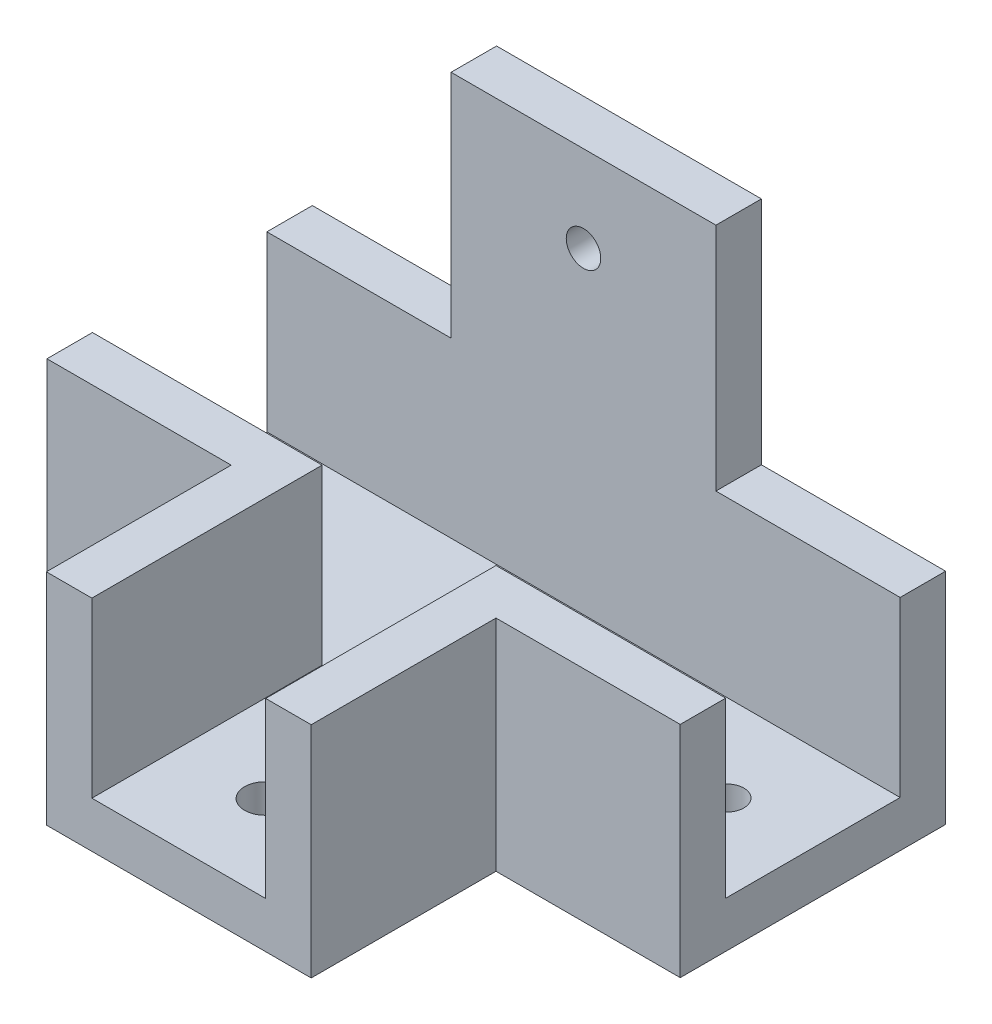
ISO-10303-21;
HEADER;
FILE_DESCRIPTION(('STEP AP214'),'2;1');
FILE_NAME('part.step','',(''),(''),'','','');
FILE_SCHEMA(('AUTOMOTIVE_DESIGN { 1 0 10303 214 1 1 1 1 }'));
ENDSEC;
DATA;
#1=APPLICATION_CONTEXT('core data for automotive mechanical design processes');
#2=APPLICATION_PROTOCOL_DEFINITION('international standard','automotive_design',2000,#1);
#3=PRODUCT_CONTEXT('',#1,'mechanical');
#4=PRODUCT('Part','Part','',(#3));
#5=PRODUCT_RELATED_PRODUCT_CATEGORY('part','',(#4));
#6=PRODUCT_DEFINITION_FORMATION('','',#4);
#7=PRODUCT_DEFINITION_CONTEXT('part definition',#1,'design');
#8=PRODUCT_DEFINITION('design','',#6,#7);
#9=PRODUCT_DEFINITION_SHAPE('','',#8);
#10=(LENGTH_UNIT() NAMED_UNIT(*) SI_UNIT(.MILLI.,.METRE.));
#11=(NAMED_UNIT(*) PLANE_ANGLE_UNIT() SI_UNIT($,.RADIAN.));
#12=(NAMED_UNIT(*) SI_UNIT($,.STERADIAN.) SOLID_ANGLE_UNIT());
#13=UNCERTAINTY_MEASURE_WITH_UNIT(LENGTH_MEASURE(1.E-05),#10,'distance_accuracy_value','');
#14=(GEOMETRIC_REPRESENTATION_CONTEXT(3) GLOBAL_UNCERTAINTY_ASSIGNED_CONTEXT((#13)) GLOBAL_UNIT_ASSIGNED_CONTEXT((#10,
#11,#12)) REPRESENTATION_CONTEXT('',''));
#15=CARTESIAN_POINT('',(0.,0.,0.));
#16=DIRECTION('',(0.,0.,1.));
#17=DIRECTION('',(1.,0.,0.));
#18=AXIS2_PLACEMENT_3D('',#15,#16,#17);
#19=CARTESIAN_POINT('',(0.,19.05,0.));
#20=DIRECTION('',(0.,1.,0.));
#21=DIRECTION('',(0.,0.,1.));
#22=AXIS2_PLACEMENT_3D('',#19,#20,#21);
#23=PLANE('',#22);
#24=DIRECTION('',(0.,0.,-1.));
#25=VECTOR('',#24,1.);
#26=CARTESIAN_POINT('',(-1.91143911439114,19.05,-13.6647601476015));
#27=LINE('',#26,#25);
#28=CARTESIAN_POINT('',(-1.91143911439114,19.05,-13.6647601476015));
#29=VERTEX_POINT('',#28);
#30=CARTESIAN_POINT('',(-1.91143911439114,19.05,-17.6147601476015));
#31=VERTEX_POINT('',#30);
#32=EDGE_CURVE('E56',#29,#31,#27,.T.);
#33=ORIENTED_EDGE('',*,*,#32,.F.);
#34=DIRECTION('',(1.,0.,0.));
#35=VECTOR('',#34,1.);
#36=CARTESIAN_POINT('',(-40.9114391143911,19.05,-13.6647601476015));
#37=LINE('',#36,#35);
#38=CARTESIAN_POINT('',(14.0885608856089,19.05,-13.6647601476015));
#39=VERTEX_POINT('',#38);
#40=EDGE_CURVE('E304',#29,#39,#37,.T.);
#41=ORIENTED_EDGE('',*,*,#40,.T.);
#42=DIRECTION('',(0.,0.,-1.));
#43=VECTOR('',#42,1.);
#44=CARTESIAN_POINT('',(14.0885608856089,19.05,-17.6147601476015));
#45=LINE('',#44,#43);
#46=CARTESIAN_POINT('',(14.0885608856089,19.05,-17.6147601476015));
#47=VERTEX_POINT('',#46);
#48=EDGE_CURVE('E307',#39,#47,#45,.T.);
#49=ORIENTED_EDGE('',*,*,#48,.T.);
#50=DIRECTION('',(-1.,0.,0.));
#51=VECTOR('',#50,1.);
#52=CARTESIAN_POINT('',(-40.9114391143911,19.05,-17.6147601476015));
#53=LINE('',#52,#51);
#54=EDGE_CURVE('E52',#47,#31,#53,.T.);
#55=ORIENTED_EDGE('',*,*,#54,.T.);
#56=EDGE_LOOP('',(#33,#41,#49,#55));
#57=FACE_BOUND('',#56,.T.);
#58=ADVANCED_FACE('F36',(#57),#23,.T.);
#59=CARTESIAN_POINT('',(0.,4.,0.));
#60=DIRECTION('',(0.,-1.,0.));
#61=DIRECTION('',(0.,0.,-1.));
#62=AXIS2_PLACEMENT_3D('',#59,#60,#61);
#63=PLANE('',#62);
#64=CARTESIAN_POINT('',(6.58856088560886,4.,-6.08976014760145));
#65=DIRECTION('',(0.,-1.,0.));
#66=DIRECTION('',(0.,0.,-1.));
#67=AXIS2_PLACEMENT_3D('',#64,#65,#66);
#68=CIRCLE('',#67,1.5);
#69=CARTESIAN_POINT('',(6.58856088560886,4.,-7.58976014760145));
#70=VERTEX_POINT('',#69);
#71=EDGE_CURVE('E393',#70,#70,#68,.T.);
#72=ORIENTED_EDGE('',*,*,#71,.T.);
#73=EDGE_LOOP('',(#72));
#74=FACE_BOUND('',#73,.T.);
#75=CARTESIAN_POINT('',(-33.4114391143911,4.,-6.08976014760145));
#76=DIRECTION('',(0.,-1.,0.));
#77=DIRECTION('',(0.,0.,-1.));
#78=AXIS2_PLACEMENT_3D('',#75,#76,#77);
#79=CIRCLE('',#78,1.5);
#80=CARTESIAN_POINT('',(-33.4114391143911,4.,-7.58976014760146));
#81=VERTEX_POINT('',#80);
#82=EDGE_CURVE('E403',#81,#81,#79,.T.);
#83=ORIENTED_EDGE('',*,*,#82,.T.);
#84=EDGE_LOOP('',(#83));
#85=FACE_BOUND('',#84,.T.);
#86=CARTESIAN_POINT('',(-13.4114391143911,4.,13.9852398523986));
#87=DIRECTION('',(0.,-1.,0.));
#88=DIRECTION('',(0.,0.,-1.));
#89=AXIS2_PLACEMENT_3D('',#86,#87,#88);
#90=CIRCLE('',#89,1.78505628029682);
#91=CARTESIAN_POINT('',(-13.4114391143911,4.,12.2001835721017));
#92=VERTEX_POINT('',#91);
#93=EDGE_CURVE('E397',#92,#92,#90,.T.);
#94=ORIENTED_EDGE('',*,*,#93,.T.);
#95=EDGE_LOOP('',(#94));
#96=FACE_BOUND('',#95,.T.);
#97=DIRECTION('',(0.,0.,-1.));
#98=VECTOR('',#97,1.);
#99=CARTESIAN_POINT('',(-20.9614391143911,4.,0.));
#100=LINE('',#99,#98);
#101=CARTESIAN_POINT('',(-20.9614391143911,4.,21.4852398523985));
#102=VERTEX_POINT('',#101);
#103=CARTESIAN_POINT('',(-20.9614391143911,4.,1.48523985239855));
#104=VERTEX_POINT('',#103);
#105=EDGE_CURVE('E208',#102,#104,#100,.T.);
#106=ORIENTED_EDGE('',*,*,#105,.F.);
#107=DIRECTION('',(1.,0.,0.));
#108=VECTOR('',#107,1.);
#109=CARTESIAN_POINT('',(0.,4.,21.4852398523985));
#110=LINE('',#109,#108);
#111=CARTESIAN_POINT('',(-5.86143911439114,4.,21.4852398523985));
#112=VERTEX_POINT('',#111);
#113=EDGE_CURVE('E270',#102,#112,#110,.T.);
#114=ORIENTED_EDGE('',*,*,#113,.T.);
#115=DIRECTION('',(0.,0.,1.));
#116=VECTOR('',#115,1.);
#117=CARTESIAN_POINT('',(-5.86143911439114,4.,0.));
#118=LINE('',#117,#116);
#119=CARTESIAN_POINT('',(-5.86143911439114,4.,1.48523985239855));
#120=VERTEX_POINT('',#119);
#121=EDGE_CURVE('E246',#120,#112,#118,.T.);
#122=ORIENTED_EDGE('',*,*,#121,.F.);
#123=DIRECTION('',(-1.,0.,0.));
#124=VECTOR('',#123,1.);
#125=CARTESIAN_POINT('',(0.,4.,1.48523985239855));
#126=LINE('',#125,#124);
#127=CARTESIAN_POINT('',(14.0885608856089,4.,1.48523985239855));
#128=VERTEX_POINT('',#127);
#129=EDGE_CURVE('E241',#128,#120,#126,.T.);
#130=ORIENTED_EDGE('',*,*,#129,.F.);
#131=DIRECTION('',(0.,0.,-1.));
#132=VECTOR('',#131,1.);
#133=CARTESIAN_POINT('',(14.0885608856089,4.,1.48523985239855));
#134=LINE('',#133,#132);
#135=CARTESIAN_POINT('',(14.0885608856089,4.,-13.6647601476015));
#136=VERTEX_POINT('',#135);
#137=EDGE_CURVE('E321',#128,#136,#134,.T.);
#138=ORIENTED_EDGE('',*,*,#137,.T.);
#139=DIRECTION('',(1.,0.,0.));
#140=VECTOR('',#139,1.);
#141=CARTESIAN_POINT('',(-40.9114391143911,4.,-13.6647601476015));
#142=LINE('',#141,#140);
#143=CARTESIAN_POINT('',(-40.9114391143911,4.,-13.6647601476015));
#144=VERTEX_POINT('',#143);
#145=EDGE_CURVE('E288',#144,#136,#142,.T.);
#146=ORIENTED_EDGE('',*,*,#145,.F.);
#147=DIRECTION('',(0.,0.,1.));
#148=VECTOR('',#147,1.);
#149=CARTESIAN_POINT('',(-40.9114391143911,4.,1.48523985239855));
#150=LINE('',#149,#148);
#151=CARTESIAN_POINT('',(-40.9114391143911,4.,1.48523985239855));
#152=VERTEX_POINT('',#151);
#153=EDGE_CURVE('E319',#144,#152,#150,.T.);
#154=ORIENTED_EDGE('',*,*,#153,.T.);
#155=DIRECTION('',(-1.,0.,0.));
#156=VECTOR('',#155,1.);
#157=CARTESIAN_POINT('',(0.,4.,1.48523985239855));
#158=LINE('',#157,#156);
#159=EDGE_CURVE('E215',#104,#152,#158,.T.);
#160=ORIENTED_EDGE('',*,*,#159,.F.);
#161=EDGE_LOOP('',(#106,#114,#122,#130,#138,#146,#154,#160));
#162=FACE_BOUND('',#161,.T.);
#163=ADVANCED_FACE('F360',(#74,#85,#96,#162),#63,.F.);
#164=CARTESIAN_POINT('',(-40.9114391143911,4.,1.48523985239855));
#165=DIRECTION('',(1.,0.,0.));
#166=DIRECTION('',(0.,0.,-1.));
#167=AXIS2_PLACEMENT_3D('',#164,#165,#166);
#168=PLANE('',#167);
#169=DIRECTION('',(0.,0.,1.));
#170=VECTOR('',#169,1.);
#171=CARTESIAN_POINT('',(-40.9114391143911,0.,1.48523985239855));
#172=LINE('',#171,#170);
#173=CARTESIAN_POINT('',(-40.9114391143911,0.,-17.6147601476015));
#174=VERTEX_POINT('',#173);
#175=CARTESIAN_POINT('',(-40.9114391143911,0.,5.43523985239855));
#176=VERTEX_POINT('',#175);
#177=EDGE_CURVE('E318',#174,#176,#172,.T.);
#178=ORIENTED_EDGE('',*,*,#177,.T.);
#179=DIRECTION('',(0.,-1.,0.));
#180=VECTOR('',#179,1.);
#181=CARTESIAN_POINT('',(-40.9114391143911,4.,5.43523985239855));
#182=LINE('',#181,#180);
#183=CARTESIAN_POINT('',(-40.9114391143911,19.05,5.43523985239855));
#184=VERTEX_POINT('',#183);
#185=EDGE_CURVE('E289',#184,#176,#182,.T.);
#186=ORIENTED_EDGE('',*,*,#185,.F.);
#187=DIRECTION('',(0.,0.,1.));
#188=VECTOR('',#187,1.);
#189=CARTESIAN_POINT('',(-40.9114391143911,19.05,0.));
#190=LINE('',#189,#188);
#191=CARTESIAN_POINT('',(-40.9114391143911,19.05,1.48523985239855));
#192=VERTEX_POINT('',#191);
#193=EDGE_CURVE('E219',#192,#184,#190,.T.);
#194=ORIENTED_EDGE('',*,*,#193,.F.);
#195=DIRECTION('',(0.,-1.,0.));
#196=VECTOR('',#195,1.);
#197=CARTESIAN_POINT('',(-40.9114391143911,19.05,1.48523985239855));
#198=LINE('',#197,#196);
#199=EDGE_CURVE('E228',#192,#152,#198,.T.);
#200=ORIENTED_EDGE('',*,*,#199,.T.);
#201=ORIENTED_EDGE('',*,*,#153,.F.);
#202=DIRECTION('',(0.,-1.,0.));
#203=VECTOR('',#202,1.);
#204=CARTESIAN_POINT('',(-40.9114391143911,19.05,-13.6647601476015));
#205=LINE('',#204,#203);
#206=CARTESIAN_POINT('',(-40.9114391143911,19.05,-13.6647601476015));
#207=VERTEX_POINT('',#206);
#208=EDGE_CURVE('E315',#207,#144,#205,.T.);
#209=ORIENTED_EDGE('',*,*,#208,.F.);
#210=DIRECTION('',(0.,0.,1.));
#211=VECTOR('',#210,1.);
#212=CARTESIAN_POINT('',(-40.9114391143911,19.05,-17.6147601476015));
#213=LINE('',#212,#211);
#214=CARTESIAN_POINT('',(-40.9114391143911,19.05,-17.6147601476015));
#215=VERTEX_POINT('',#214);
#216=EDGE_CURVE('E301',#215,#207,#213,.T.);
#217=ORIENTED_EDGE('',*,*,#216,.F.);
#218=DIRECTION('',(0.,-1.,0.));
#219=VECTOR('',#218,1.);
#220=CARTESIAN_POINT('',(-40.9114391143911,4.,-17.6147601476015));
#221=LINE('',#220,#219);
#222=EDGE_CURVE('E45',#215,#174,#221,.T.);
#223=ORIENTED_EDGE('',*,*,#222,.T.);
#224=EDGE_LOOP('',(#178,#186,#194,#200,#201,#209,#217,#223));
#225=FACE_BOUND('',#224,.T.);
#226=ADVANCED_FACE('F38',(#225),#168,.F.);
#227=CARTESIAN_POINT('',(14.0885608856089,4.,1.48523985239855));
#228=DIRECTION('',(-1.,0.,0.));
#229=DIRECTION('',(0.,0.,1.));
#230=AXIS2_PLACEMENT_3D('',#227,#228,#229);
#231=PLANE('',#230);
#232=DIRECTION('',(0.,0.,-1.));
#233=VECTOR('',#232,1.);
#234=CARTESIAN_POINT('',(14.0885608856089,0.,1.48523985239855));
#235=LINE('',#234,#233);
#236=CARTESIAN_POINT('',(14.0885608856089,0.,5.43523985239855));
#237=VERTEX_POINT('',#236);
#238=CARTESIAN_POINT('',(14.0885608856089,0.,-17.6147601476015));
#239=VERTEX_POINT('',#238);
#240=EDGE_CURVE('E325',#237,#239,#235,.T.);
#241=ORIENTED_EDGE('',*,*,#240,.T.);
#242=DIRECTION('',(0.,-1.,0.));
#243=VECTOR('',#242,1.);
#244=CARTESIAN_POINT('',(14.0885608856089,4.,-17.6147601476015));
#245=LINE('',#244,#243);
#246=EDGE_CURVE('E11',#47,#239,#245,.T.);
#247=ORIENTED_EDGE('',*,*,#246,.F.);
#248=ORIENTED_EDGE('',*,*,#48,.F.);
#249=DIRECTION('',(0.,-1.,0.));
#250=VECTOR('',#249,1.);
#251=CARTESIAN_POINT('',(14.0885608856089,19.05,-13.6647601476015));
#252=LINE('',#251,#250);
#253=EDGE_CURVE('E311',#39,#136,#252,.T.);
#254=ORIENTED_EDGE('',*,*,#253,.T.);
#255=ORIENTED_EDGE('',*,*,#137,.F.);
#256=DIRECTION('',(0.,-1.,0.));
#257=VECTOR('',#256,1.);
#258=CARTESIAN_POINT('',(14.0885608856089,19.05,1.48523985239855));
#259=LINE('',#258,#257);
#260=CARTESIAN_POINT('',(14.0885608856089,19.05,1.48523985239855));
#261=VERTEX_POINT('',#260);
#262=EDGE_CURVE('E267',#261,#128,#259,.T.);
#263=ORIENTED_EDGE('',*,*,#262,.F.);
#264=DIRECTION('',(0.,0.,-1.));
#265=VECTOR('',#264,1.);
#266=CARTESIAN_POINT('',(14.0885608856089,19.05,0.));
#267=LINE('',#266,#265);
#268=CARTESIAN_POINT('',(14.0885608856089,19.05,5.43523985239855));
#269=VERTEX_POINT('',#268);
#270=EDGE_CURVE('E249',#269,#261,#267,.T.);
#271=ORIENTED_EDGE('',*,*,#270,.F.);
#272=DIRECTION('',(0.,-1.,0.));
#273=VECTOR('',#272,1.);
#274=CARTESIAN_POINT('',(14.0885608856089,4.,5.43523985239855));
#275=LINE('',#274,#273);
#276=EDGE_CURVE('E285',#269,#237,#275,.T.);
#277=ORIENTED_EDGE('',*,*,#276,.T.);
#278=EDGE_LOOP('',(#241,#247,#248,#254,#255,#263,#271,#277));
#279=FACE_BOUND('',#278,.T.);
#280=ADVANCED_FACE('F379',(#279),#231,.F.);
#281=CARTESIAN_POINT('',(-40.9114391143911,4.,-17.6147601476015));
#282=DIRECTION('',(0.,0.,1.));
#283=DIRECTION('',(1.,0.,0.));
#284=AXIS2_PLACEMENT_3D('',#281,#282,#283);
#285=PLANE('',#284);
#286=CARTESIAN_POINT('',(-13.4114391143911,31.55,-17.6147601476015));
#287=DIRECTION('',(0.,0.,-1.));
#288=DIRECTION('',(-1.,0.,0.));
#289=AXIS2_PLACEMENT_3D('',#286,#287,#288);
#290=CIRCLE('',#289,1.5);
#291=CARTESIAN_POINT('',(-14.9114391143911,31.55,-17.6147601476015));
#292=VERTEX_POINT('',#291);
#293=EDGE_CURVE('E390',#292,#292,#290,.T.);
#294=ORIENTED_EDGE('',*,*,#293,.F.);
#295=EDGE_LOOP('',(#294));
#296=FACE_BOUND('',#295,.T.);
#297=DIRECTION('',(-1.,0.,0.));
#298=VECTOR('',#297,1.);
#299=CARTESIAN_POINT('',(-40.9114391143911,0.,-17.6147601476015));
#300=LINE('',#299,#298);
#301=EDGE_CURVE('E322',#239,#174,#300,.T.);
#302=ORIENTED_EDGE('',*,*,#301,.T.);
#303=ORIENTED_EDGE('',*,*,#222,.F.);
#304=CARTESIAN_POINT('',(-24.9114391143911,19.05,-17.6147601476015));
#305=VERTEX_POINT('',#304);
#306=EDGE_CURVE('E309',#305,#215,#53,.T.);
#307=ORIENTED_EDGE('',*,*,#306,.F.);
#308=DIRECTION('',(0.,1.,0.));
#309=VECTOR('',#308,1.);
#310=CARTESIAN_POINT('',(-24.9114391143911,19.05,-17.6147601476015));
#311=LINE('',#310,#309);
#312=CARTESIAN_POINT('',(-24.9114391143911,39.05,-17.6147601476015));
#313=VERTEX_POINT('',#312);
#314=EDGE_CURVE('E205',#305,#313,#311,.T.);
#315=ORIENTED_EDGE('',*,*,#314,.T.);
#316=DIRECTION('',(1.,0.,0.));
#317=VECTOR('',#316,1.);
#318=CARTESIAN_POINT('',(-1.91143911439114,39.05,-17.6147601476015));
#319=LINE('',#318,#317);
#320=CARTESIAN_POINT('',(-1.91143911439114,39.05,-17.6147601476015));
#321=VERTEX_POINT('',#320);
#322=EDGE_CURVE('E179',#313,#321,#319,.T.);
#323=ORIENTED_EDGE('',*,*,#322,.T.);
#324=DIRECTION('',(0.,-1.,0.));
#325=VECTOR('',#324,1.);
#326=CARTESIAN_POINT('',(-1.91143911439114,19.05,-17.6147601476015));
#327=LINE('',#326,#325);
#328=EDGE_CURVE('E202',#321,#31,#327,.T.);
#329=ORIENTED_EDGE('',*,*,#328,.T.);
#330=ORIENTED_EDGE('',*,*,#54,.F.);
#331=ORIENTED_EDGE('',*,*,#246,.T.);
#332=EDGE_LOOP('',(#302,#303,#307,#315,#323,#329,#330,#331));
#333=FACE_BOUND('',#332,.T.);
#334=ADVANCED_FACE('F385',(#296,#333),#285,.F.);
#335=CARTESIAN_POINT('',(0.,0.,0.));
#336=DIRECTION('',(0.,-1.,0.));
#337=DIRECTION('',(0.,0.,-1.));
#338=AXIS2_PLACEMENT_3D('',#335,#336,#337);
#339=PLANE('',#338);
#340=CARTESIAN_POINT('',(6.58856088560886,0.,-6.08976014760145));
#341=DIRECTION('',(0.,-1.,0.));
#342=DIRECTION('',(0.,0.,-1.));
#343=AXIS2_PLACEMENT_3D('',#340,#341,#342);
#344=CIRCLE('',#343,1.5);
#345=CARTESIAN_POINT('',(6.58856088560886,0.,-7.58976014760145));
#346=VERTEX_POINT('',#345);
#347=EDGE_CURVE('E406',#346,#346,#344,.T.);
#348=ORIENTED_EDGE('',*,*,#347,.F.);
#349=EDGE_LOOP('',(#348));
#350=FACE_BOUND('',#349,.T.);
#351=CARTESIAN_POINT('',(-33.4114391143911,0.,-6.08976014760145));
#352=DIRECTION('',(0.,-1.,0.));
#353=DIRECTION('',(0.,0.,-1.));
#354=AXIS2_PLACEMENT_3D('',#351,#352,#353);
#355=CIRCLE('',#354,1.5);
#356=CARTESIAN_POINT('',(-33.4114391143911,0.,-7.58976014760146));
#357=VERTEX_POINT('',#356);
#358=EDGE_CURVE('E400',#357,#357,#355,.T.);
#359=ORIENTED_EDGE('',*,*,#358,.F.);
#360=EDGE_LOOP('',(#359));
#361=FACE_BOUND('',#360,.T.);
#362=CARTESIAN_POINT('',(-13.4114391143911,0.,13.9852398523986));
#363=DIRECTION('',(0.,-1.,0.));
#364=DIRECTION('',(0.,0.,-1.));
#365=AXIS2_PLACEMENT_3D('',#362,#363,#364);
#366=CIRCLE('',#365,1.78505628029682);
#367=CARTESIAN_POINT('',(-13.4114391143911,0.,12.2001835721017));
#368=VERTEX_POINT('',#367);
#369=EDGE_CURVE('E394',#368,#368,#366,.T.);
#370=ORIENTED_EDGE('',*,*,#369,.F.);
#371=EDGE_LOOP('',(#370));
#372=FACE_BOUND('',#371,.T.);
#373=ORIENTED_EDGE('',*,*,#177,.F.);
#374=ORIENTED_EDGE('',*,*,#301,.F.);
#375=ORIENTED_EDGE('',*,*,#240,.F.);
#376=DIRECTION('',(1.,0.,0.));
#377=VECTOR('',#376,1.);
#378=CARTESIAN_POINT('',(0.,0.,5.43523985239855));
#379=LINE('',#378,#377);
#380=CARTESIAN_POINT('',(-1.91143911439114,0.,5.43523985239855));
#381=VERTEX_POINT('',#380);
#382=EDGE_CURVE('E269',#381,#237,#379,.T.);
#383=ORIENTED_EDGE('',*,*,#382,.F.);
#384=DIRECTION('',(0.,0.,1.));
#385=VECTOR('',#384,1.);
#386=CARTESIAN_POINT('',(-1.91143911439114,0.,0.));
#387=LINE('',#386,#385);
#388=CARTESIAN_POINT('',(-1.91143911439114,0.,21.4852398523985));
#389=VERTEX_POINT('',#388);
#390=EDGE_CURVE('E276',#381,#389,#387,.T.);
#391=ORIENTED_EDGE('',*,*,#390,.T.);
#392=DIRECTION('',(1.,0.,0.));
#393=VECTOR('',#392,1.);
#394=CARTESIAN_POINT('',(0.,0.,21.4852398523985));
#395=LINE('',#394,#393);
#396=CARTESIAN_POINT('',(-24.9114391143911,0.,21.4852398523985));
#397=VERTEX_POINT('',#396);
#398=EDGE_CURVE('E279',#397,#389,#395,.T.);
#399=ORIENTED_EDGE('',*,*,#398,.F.);
#400=DIRECTION('',(0.,0.,1.));
#401=VECTOR('',#400,1.);
#402=CARTESIAN_POINT('',(-24.9114391143911,0.,0.));
#403=LINE('',#402,#401);
#404=CARTESIAN_POINT('',(-24.9114391143911,0.,5.43523985239855));
#405=VERTEX_POINT('',#404);
#406=EDGE_CURVE('E282',#405,#397,#403,.T.);
#407=ORIENTED_EDGE('',*,*,#406,.F.);
#408=DIRECTION('',(1.,0.,0.));
#409=VECTOR('',#408,1.);
#410=CARTESIAN_POINT('',(0.,0.,5.43523985239855));
#411=LINE('',#410,#409);
#412=EDGE_CURVE('E273',#176,#405,#411,.T.);
#413=ORIENTED_EDGE('',*,*,#412,.F.);
#414=EDGE_LOOP('',(#373,#374,#375,#383,#391,#399,#407,#413));
#415=FACE_BOUND('',#414,.T.);
#416=ADVANCED_FACE('F338',(#350,#361,#372,#415),#339,.T.);
#417=CARTESIAN_POINT('',(-40.9114391143911,19.05,-13.6647601476015));
#418=DIRECTION('',(0.,0.,-1.));
#419=DIRECTION('',(-1.,0.,0.));
#420=AXIS2_PLACEMENT_3D('',#417,#418,#419);
#421=PLANE('',#420);
#422=CARTESIAN_POINT('',(-13.4114391143911,31.55,-13.6647601476015));
#423=DIRECTION('',(0.,0.,-1.));
#424=DIRECTION('',(-1.,0.,0.));
#425=AXIS2_PLACEMENT_3D('',#422,#423,#424);
#426=CIRCLE('',#425,1.5);
#427=CARTESIAN_POINT('',(-14.9114391143911,31.55,-13.6647601476015));
#428=VERTEX_POINT('',#427);
#429=EDGE_CURVE('E40',#428,#428,#426,.T.);
#430=ORIENTED_EDGE('',*,*,#429,.T.);
#431=EDGE_LOOP('',(#430));
#432=FACE_BOUND('',#431,.T.);
#433=ORIENTED_EDGE('',*,*,#145,.T.);
#434=ORIENTED_EDGE('',*,*,#253,.F.);
#435=ORIENTED_EDGE('',*,*,#40,.F.);
#436=DIRECTION('',(0.,-1.,0.));
#437=VECTOR('',#436,1.);
#438=CARTESIAN_POINT('',(-1.91143911439114,19.05,-13.6647601476015));
#439=LINE('',#438,#437);
#440=CARTESIAN_POINT('',(-1.91143911439114,39.05,-13.6647601476015));
#441=VERTEX_POINT('',#440);
#442=EDGE_CURVE('E192',#441,#29,#439,.T.);
#443=ORIENTED_EDGE('',*,*,#442,.F.);
#444=DIRECTION('',(1.,0.,0.));
#445=VECTOR('',#444,1.);
#446=CARTESIAN_POINT('',(-1.91143911439114,39.05,-13.6647601476015));
#447=LINE('',#446,#445);
#448=CARTESIAN_POINT('',(-24.9114391143911,39.05,-13.6647601476015));
#449=VERTEX_POINT('',#448);
#450=EDGE_CURVE('E177',#449,#441,#447,.T.);
#451=ORIENTED_EDGE('',*,*,#450,.F.);
#452=DIRECTION('',(0.,1.,0.));
#453=VECTOR('',#452,1.);
#454=CARTESIAN_POINT('',(-24.9114391143911,19.05,-13.6647601476015));
#455=LINE('',#454,#453);
#456=CARTESIAN_POINT('',(-24.9114391143911,19.05,-13.6647601476015));
#457=VERTEX_POINT('',#456);
#458=EDGE_CURVE('E188',#457,#449,#455,.T.);
#459=ORIENTED_EDGE('',*,*,#458,.F.);
#460=EDGE_CURVE('E305',#207,#457,#37,.T.);
#461=ORIENTED_EDGE('',*,*,#460,.F.);
#462=ORIENTED_EDGE('',*,*,#208,.T.);
#463=EDGE_LOOP('',(#433,#434,#435,#443,#451,#459,#461,#462));
#464=FACE_BOUND('',#463,.T.);
#465=ADVANCED_FACE('F196',(#432,#464),#421,.F.);
#466=DIRECTION('',(0.,0.,-1.));
#467=VECTOR('',#466,1.);
#468=CARTESIAN_POINT('',(-24.9114391143911,19.05,-13.6647601476015));
#469=LINE('',#468,#467);
#470=EDGE_CURVE('E184',#457,#305,#469,.T.);
#471=ORIENTED_EDGE('',*,*,#470,.T.);
#472=ORIENTED_EDGE('',*,*,#306,.T.);
#473=ORIENTED_EDGE('',*,*,#216,.T.);
#474=ORIENTED_EDGE('',*,*,#460,.T.);
#475=EDGE_LOOP('',(#471,#472,#473,#474));
#476=FACE_BOUND('',#475,.T.);
#477=ADVANCED_FACE('F384',(#476),#23,.T.);
#478=CARTESIAN_POINT('',(0.,4.,5.43523985239855));
#479=DIRECTION('',(0.,0.,-1.));
#480=DIRECTION('',(-1.,0.,0.));
#481=AXIS2_PLACEMENT_3D('',#478,#479,#480);
#482=PLANE('',#481);
#483=ORIENTED_EDGE('',*,*,#382,.T.);
#484=ORIENTED_EDGE('',*,*,#276,.F.);
#485=DIRECTION('',(-1.,0.,0.));
#486=VECTOR('',#485,1.);
#487=CARTESIAN_POINT('',(0.,19.05,5.43523985239855));
#488=LINE('',#487,#486);
#489=CARTESIAN_POINT('',(-1.91143911439114,19.05,5.43523985239855));
#490=VERTEX_POINT('',#489);
#491=EDGE_CURVE('E245',#269,#490,#488,.T.);
#492=ORIENTED_EDGE('',*,*,#491,.T.);
#493=DIRECTION('',(0.,-1.,0.));
#494=VECTOR('',#493,1.);
#495=CARTESIAN_POINT('',(-1.91143911439114,4.,5.43523985239855));
#496=LINE('',#495,#494);
#497=EDGE_CURVE('E272',#490,#381,#496,.T.);
#498=ORIENTED_EDGE('',*,*,#497,.T.);
#499=EDGE_LOOP('',(#483,#484,#492,#498));
#500=FACE_BOUND('',#499,.T.);
#501=ADVANCED_FACE('F452',(#500),#482,.F.);
#502=CARTESIAN_POINT('',(0.,4.,5.43523985239855));
#503=DIRECTION('',(0.,0.,-1.));
#504=DIRECTION('',(-1.,0.,0.));
#505=AXIS2_PLACEMENT_3D('',#502,#503,#504);
#506=PLANE('',#505);
#507=ORIENTED_EDGE('',*,*,#412,.T.);
#508=DIRECTION('',(0.,-1.,0.));
#509=VECTOR('',#508,1.);
#510=CARTESIAN_POINT('',(-24.9114391143911,4.,5.43523985239855));
#511=LINE('',#510,#509);
#512=CARTESIAN_POINT('',(-24.9114391143911,19.05,5.43523985239855));
#513=VERTEX_POINT('',#512);
#514=EDGE_CURVE('E292',#513,#405,#511,.T.);
#515=ORIENTED_EDGE('',*,*,#514,.F.);
#516=DIRECTION('',(1.,0.,0.));
#517=VECTOR('',#516,1.);
#518=CARTESIAN_POINT('',(0.,19.05,5.43523985239855));
#519=LINE('',#518,#517);
#520=EDGE_CURVE('E222',#184,#513,#519,.T.);
#521=ORIENTED_EDGE('',*,*,#520,.F.);
#522=ORIENTED_EDGE('',*,*,#185,.T.);
#523=EDGE_LOOP('',(#507,#515,#521,#522));
#524=FACE_BOUND('',#523,.T.);
#525=ADVANCED_FACE('F342',(#524),#506,.F.);
#526=CARTESIAN_POINT('',(-24.9114391143911,4.,0.));
#527=DIRECTION('',(1.,0.,0.));
#528=DIRECTION('',(0.,0.,-1.));
#529=AXIS2_PLACEMENT_3D('',#526,#527,#528);
#530=PLANE('',#529);
#531=ORIENTED_EDGE('',*,*,#406,.T.);
#532=DIRECTION('',(0.,-1.,0.));
#533=VECTOR('',#532,1.);
#534=CARTESIAN_POINT('',(-24.9114391143911,4.,21.4852398523985));
#535=LINE('',#534,#533);
#536=CARTESIAN_POINT('',(-24.9114391143911,19.05,21.4852398523985));
#537=VERTEX_POINT('',#536);
#538=EDGE_CURVE('E295',#537,#397,#535,.T.);
#539=ORIENTED_EDGE('',*,*,#538,.F.);
#540=DIRECTION('',(0.,0.,-1.));
#541=VECTOR('',#540,1.);
#542=CARTESIAN_POINT('',(-24.9114391143911,19.05,0.));
#543=LINE('',#542,#541);
#544=EDGE_CURVE('E225',#537,#513,#543,.T.);
#545=ORIENTED_EDGE('',*,*,#544,.T.);
#546=ORIENTED_EDGE('',*,*,#514,.T.);
#547=EDGE_LOOP('',(#531,#539,#545,#546));
#548=FACE_BOUND('',#547,.T.);
#549=ADVANCED_FACE('F345',(#548),#530,.F.);
#550=CARTESIAN_POINT('',(0.,4.,21.4852398523985));
#551=DIRECTION('',(0.,0.,-1.));
#552=DIRECTION('',(-1.,0.,0.));
#553=AXIS2_PLACEMENT_3D('',#550,#551,#552);
#554=PLANE('',#553);
#555=ORIENTED_EDGE('',*,*,#398,.T.);
#556=DIRECTION('',(0.,-1.,0.));
#557=VECTOR('',#556,1.);
#558=CARTESIAN_POINT('',(-1.91143911439114,4.,21.4852398523985));
#559=LINE('',#558,#557);
#560=CARTESIAN_POINT('',(-1.91143911439114,19.05,21.4852398523985));
#561=VERTEX_POINT('',#560);
#562=EDGE_CURVE('E298',#561,#389,#559,.T.);
#563=ORIENTED_EDGE('',*,*,#562,.F.);
#564=DIRECTION('',(1.,0.,0.));
#565=VECTOR('',#564,1.);
#566=CARTESIAN_POINT('',(0.,19.05,21.4852398523985));
#567=LINE('',#566,#565);
#568=CARTESIAN_POINT('',(-5.86143911439114,19.05,21.4852398523985));
#569=VERTEX_POINT('',#568);
#570=EDGE_CURVE('E255',#569,#561,#567,.T.);
#571=ORIENTED_EDGE('',*,*,#570,.F.);
#572=DIRECTION('',(0.,-1.,0.));
#573=VECTOR('',#572,1.);
#574=CARTESIAN_POINT('',(-5.86143911439114,19.05,21.4852398523985));
#575=LINE('',#574,#573);
#576=EDGE_CURVE('E258',#569,#112,#575,.T.);
#577=ORIENTED_EDGE('',*,*,#576,.T.);
#578=ORIENTED_EDGE('',*,*,#113,.F.);
#579=DIRECTION('',(0.,-1.,0.));
#580=VECTOR('',#579,1.);
#581=CARTESIAN_POINT('',(-20.9614391143911,19.05,21.4852398523985));
#582=LINE('',#581,#580);
#583=CARTESIAN_POINT('',(-20.9614391143911,19.05,21.4852398523985));
#584=VERTEX_POINT('',#583);
#585=EDGE_CURVE('E238',#584,#102,#582,.T.);
#586=ORIENTED_EDGE('',*,*,#585,.F.);
#587=DIRECTION('',(1.,0.,0.));
#588=VECTOR('',#587,1.);
#589=CARTESIAN_POINT('',(0.,19.05,21.4852398523985));
#590=LINE('',#589,#588);
#591=EDGE_CURVE('E211',#537,#584,#590,.T.);
#592=ORIENTED_EDGE('',*,*,#591,.F.);
#593=ORIENTED_EDGE('',*,*,#538,.T.);
#594=EDGE_LOOP('',(#555,#563,#571,#577,#578,#586,#592,#593));
#595=FACE_BOUND('',#594,.T.);
#596=ADVANCED_FACE('F364',(#595),#554,.F.);
#597=CARTESIAN_POINT('',(-1.91143911439114,4.,0.));
#598=DIRECTION('',(1.,0.,0.));
#599=DIRECTION('',(0.,0.,-1.));
#600=AXIS2_PLACEMENT_3D('',#597,#598,#599);
#601=PLANE('',#600);
#602=ORIENTED_EDGE('',*,*,#390,.F.);
#603=ORIENTED_EDGE('',*,*,#497,.F.);
#604=DIRECTION('',(0.,0.,-1.));
#605=VECTOR('',#604,1.);
#606=CARTESIAN_POINT('',(-1.91143911439114,19.05,0.));
#607=LINE('',#606,#605);
#608=EDGE_CURVE('E242',#561,#490,#607,.T.);
#609=ORIENTED_EDGE('',*,*,#608,.F.);
#610=ORIENTED_EDGE('',*,*,#562,.T.);
#611=EDGE_LOOP('',(#602,#603,#609,#610));
#612=FACE_BOUND('',#611,.T.);
#613=ADVANCED_FACE('F602',(#612),#601,.T.);
#614=CARTESIAN_POINT('',(0.,19.05,1.48523985239855));
#615=DIRECTION('',(0.,0.,1.));
#616=DIRECTION('',(1.,0.,0.));
#617=AXIS2_PLACEMENT_3D('',#614,#615,#616);
#618=PLANE('',#617);
#619=ORIENTED_EDGE('',*,*,#129,.T.);
#620=DIRECTION('',(0.,-1.,0.));
#621=VECTOR('',#620,1.);
#622=CARTESIAN_POINT('',(-5.86143911439114,19.05,1.48523985239855));
#623=LINE('',#622,#621);
#624=CARTESIAN_POINT('',(-5.86143911439114,19.05,1.48523985239855));
#625=VERTEX_POINT('',#624);
#626=EDGE_CURVE('E264',#625,#120,#623,.T.);
#627=ORIENTED_EDGE('',*,*,#626,.F.);
#628=DIRECTION('',(-1.,0.,0.));
#629=VECTOR('',#628,1.);
#630=CARTESIAN_POINT('',(0.,19.05,1.48523985239855));
#631=LINE('',#630,#629);
#632=EDGE_CURVE('E251',#261,#625,#631,.T.);
#633=ORIENTED_EDGE('',*,*,#632,.F.);
#634=ORIENTED_EDGE('',*,*,#262,.T.);
#635=EDGE_LOOP('',(#619,#627,#633,#634));
#636=FACE_BOUND('',#635,.T.);
#637=ADVANCED_FACE('F375',(#636),#618,.F.);
#638=CARTESIAN_POINT('',(-5.86143911439114,19.05,0.));
#639=DIRECTION('',(1.,0.,0.));
#640=DIRECTION('',(0.,0.,-1.));
#641=AXIS2_PLACEMENT_3D('',#638,#639,#640);
#642=PLANE('',#641);
#643=ORIENTED_EDGE('',*,*,#121,.T.);
#644=ORIENTED_EDGE('',*,*,#576,.F.);
#645=DIRECTION('',(0.,0.,1.));
#646=VECTOR('',#645,1.);
#647=CARTESIAN_POINT('',(-5.86143911439114,19.05,0.));
#648=LINE('',#647,#646);
#649=EDGE_CURVE('E253',#625,#569,#648,.T.);
#650=ORIENTED_EDGE('',*,*,#649,.F.);
#651=ORIENTED_EDGE('',*,*,#626,.T.);
#652=EDGE_LOOP('',(#643,#644,#650,#651));
#653=FACE_BOUND('',#652,.T.);
#654=ADVANCED_FACE('F370',(#653),#642,.F.);
#655=CARTESIAN_POINT('',(0.,19.05,0.));
#656=DIRECTION('',(0.,1.,0.));
#657=DIRECTION('',(0.,0.,1.));
#658=AXIS2_PLACEMENT_3D('',#655,#656,#657);
#659=PLANE('',#658);
#660=ORIENTED_EDGE('',*,*,#608,.T.);
#661=ORIENTED_EDGE('',*,*,#491,.F.);
#662=ORIENTED_EDGE('',*,*,#270,.T.);
#663=ORIENTED_EDGE('',*,*,#632,.T.);
#664=ORIENTED_EDGE('',*,*,#649,.T.);
#665=ORIENTED_EDGE('',*,*,#570,.T.);
#666=EDGE_LOOP('',(#660,#661,#662,#663,#664,#665));
#667=FACE_BOUND('',#666,.T.);
#668=ADVANCED_FACE('F573',(#667),#659,.T.);
#669=CARTESIAN_POINT('',(-20.9614391143911,19.05,0.));
#670=DIRECTION('',(-1.,0.,0.));
#671=DIRECTION('',(0.,0.,1.));
#672=AXIS2_PLACEMENT_3D('',#669,#670,#671);
#673=PLANE('',#672);
#674=ORIENTED_EDGE('',*,*,#105,.T.);
#675=DIRECTION('',(0.,-1.,0.));
#676=VECTOR('',#675,1.);
#677=CARTESIAN_POINT('',(-20.9614391143911,19.05,1.48523985239855));
#678=LINE('',#677,#676);
#679=CARTESIAN_POINT('',(-20.9614391143911,19.05,1.48523985239855));
#680=VERTEX_POINT('',#679);
#681=EDGE_CURVE('E235',#680,#104,#678,.T.);
#682=ORIENTED_EDGE('',*,*,#681,.F.);
#683=DIRECTION('',(0.,0.,-1.));
#684=VECTOR('',#683,1.);
#685=CARTESIAN_POINT('',(-20.9614391143911,19.05,0.));
#686=LINE('',#685,#684);
#687=EDGE_CURVE('E214',#584,#680,#686,.T.);
#688=ORIENTED_EDGE('',*,*,#687,.F.);
#689=ORIENTED_EDGE('',*,*,#585,.T.);
#690=EDGE_LOOP('',(#674,#682,#688,#689));
#691=FACE_BOUND('',#690,.T.);
#692=ADVANCED_FACE('F362',(#691),#673,.F.);
#693=CARTESIAN_POINT('',(0.,19.05,1.48523985239855));
#694=DIRECTION('',(0.,0.,1.));
#695=DIRECTION('',(1.,0.,0.));
#696=AXIS2_PLACEMENT_3D('',#693,#694,#695);
#697=PLANE('',#696);
#698=ORIENTED_EDGE('',*,*,#159,.T.);
#699=ORIENTED_EDGE('',*,*,#199,.F.);
#700=DIRECTION('',(-1.,0.,0.));
#701=VECTOR('',#700,1.);
#702=CARTESIAN_POINT('',(0.,19.05,1.48523985239855));
#703=LINE('',#702,#701);
#704=EDGE_CURVE('E217',#680,#192,#703,.T.);
#705=ORIENTED_EDGE('',*,*,#704,.F.);
#706=ORIENTED_EDGE('',*,*,#681,.T.);
#707=EDGE_LOOP('',(#698,#699,#705,#706));
#708=FACE_BOUND('',#707,.T.);
#709=ADVANCED_FACE('F356',(#708),#697,.F.);
#710=CARTESIAN_POINT('',(0.,19.05,0.));
#711=DIRECTION('',(0.,1.,0.));
#712=DIRECTION('',(0.,0.,1.));
#713=AXIS2_PLACEMENT_3D('',#710,#711,#712);
#714=PLANE('',#713);
#715=ORIENTED_EDGE('',*,*,#591,.T.);
#716=ORIENTED_EDGE('',*,*,#687,.T.);
#717=ORIENTED_EDGE('',*,*,#704,.T.);
#718=ORIENTED_EDGE('',*,*,#193,.T.);
#719=ORIENTED_EDGE('',*,*,#520,.T.);
#720=ORIENTED_EDGE('',*,*,#544,.F.);
#721=EDGE_LOOP('',(#715,#716,#717,#718,#719,#720));
#722=FACE_BOUND('',#721,.T.);
#723=ADVANCED_FACE('F349',(#722),#714,.T.);
#724=CARTESIAN_POINT('',(-1.91143911439114,19.05,-13.6647601476015));
#725=DIRECTION('',(1.,0.,0.));
#726=DIRECTION('',(0.,0.,-1.));
#727=AXIS2_PLACEMENT_3D('',#724,#725,#726);
#728=PLANE('',#727);
#729=ORIENTED_EDGE('',*,*,#328,.F.);
#730=DIRECTION('',(0.,0.,-1.));
#731=VECTOR('',#730,1.);
#732=CARTESIAN_POINT('',(-1.91143911439114,39.05,-13.6647601476015));
#733=LINE('',#732,#731);
#734=EDGE_CURVE('E183',#441,#321,#733,.T.);
#735=ORIENTED_EDGE('',*,*,#734,.F.);
#736=ORIENTED_EDGE('',*,*,#442,.T.);
#737=ORIENTED_EDGE('',*,*,#32,.T.);
#738=EDGE_LOOP('',(#729,#735,#736,#737));
#739=FACE_BOUND('',#738,.T.);
#740=ADVANCED_FACE('F388',(#739),#728,.T.);
#741=CARTESIAN_POINT('',(-1.91143911439114,39.05,-13.6647601476015));
#742=DIRECTION('',(0.,1.,0.));
#743=DIRECTION('',(0.,0.,1.));
#744=AXIS2_PLACEMENT_3D('',#741,#742,#743);
#745=PLANE('',#744);
#746=ORIENTED_EDGE('',*,*,#322,.F.);
#747=DIRECTION('',(0.,0.,-1.));
#748=VECTOR('',#747,1.);
#749=CARTESIAN_POINT('',(-24.9114391143911,39.05,-13.6647601476015));
#750=LINE('',#749,#748);
#751=EDGE_CURVE('E173',#449,#313,#750,.T.);
#752=ORIENTED_EDGE('',*,*,#751,.F.);
#753=ORIENTED_EDGE('',*,*,#450,.T.);
#754=ORIENTED_EDGE('',*,*,#734,.T.);
#755=EDGE_LOOP('',(#746,#752,#753,#754));
#756=FACE_BOUND('',#755,.T.);
#757=ADVANCED_FACE('F175',(#756),#745,.T.);
#758=CARTESIAN_POINT('',(-24.9114391143911,19.05,-13.6647601476015));
#759=DIRECTION('',(-1.,0.,0.));
#760=DIRECTION('',(0.,0.,1.));
#761=AXIS2_PLACEMENT_3D('',#758,#759,#760);
#762=PLANE('',#761);
#763=ORIENTED_EDGE('',*,*,#314,.F.);
#764=ORIENTED_EDGE('',*,*,#470,.F.);
#765=ORIENTED_EDGE('',*,*,#458,.T.);
#766=ORIENTED_EDGE('',*,*,#751,.T.);
#767=EDGE_LOOP('',(#763,#764,#765,#766));
#768=FACE_BOUND('',#767,.T.);
#769=ADVANCED_FACE('F189',(#768),#762,.T.);
#770=CARTESIAN_POINT('',(-13.4114391143911,31.55,-13.6147601476015));
#771=DIRECTION('',(0.,0.,-1.));
#772=DIRECTION('',(-1.,0.,0.));
#773=AXIS2_PLACEMENT_3D('',#770,#771,#772);
#774=CYLINDRICAL_SURFACE('',#773,1.5);
#775=ORIENTED_EDGE('',*,*,#293,.T.);
#776=EDGE_LOOP('',(#775));
#777=FACE_BOUND('',#776,.T.);
#778=ORIENTED_EDGE('',*,*,#429,.F.);
#779=EDGE_LOOP('',(#778));
#780=FACE_BOUND('',#779,.T.);
#781=ADVANCED_FACE('F430',(#777,#780),#774,.F.);
#782=CARTESIAN_POINT('',(-13.4114391143911,4.,13.9852398523986));
#783=DIRECTION('',(0.,-1.,0.));
#784=DIRECTION('',(0.,0.,-1.));
#785=AXIS2_PLACEMENT_3D('',#782,#783,#784);
#786=CYLINDRICAL_SURFACE('',#785,1.78505628029682);
#787=ORIENTED_EDGE('',*,*,#93,.F.);
#788=EDGE_LOOP('',(#787));
#789=FACE_BOUND('',#788,.T.);
#790=ORIENTED_EDGE('',*,*,#369,.T.);
#791=EDGE_LOOP('',(#790));
#792=FACE_BOUND('',#791,.T.);
#793=ADVANCED_FACE('F428',(#789,#792),#786,.F.);
#794=CARTESIAN_POINT('',(-33.4114391143911,4.,-6.08976014760145));
#795=DIRECTION('',(0.,-1.,0.));
#796=DIRECTION('',(0.,0.,-1.));
#797=AXIS2_PLACEMENT_3D('',#794,#795,#796);
#798=CYLINDRICAL_SURFACE('',#797,1.5);
#799=ORIENTED_EDGE('',*,*,#82,.F.);
#800=EDGE_LOOP('',(#799));
#801=FACE_BOUND('',#800,.T.);
#802=ORIENTED_EDGE('',*,*,#358,.T.);
#803=EDGE_LOOP('',(#802));
#804=FACE_BOUND('',#803,.T.);
#805=ADVANCED_FACE('F417',(#801,#804),#798,.F.);
#806=CARTESIAN_POINT('',(6.58856088560886,4.,-6.08976014760145));
#807=DIRECTION('',(0.,-1.,0.));
#808=DIRECTION('',(0.,0.,-1.));
#809=AXIS2_PLACEMENT_3D('',#806,#807,#808);
#810=CYLINDRICAL_SURFACE('',#809,1.5);
#811=ORIENTED_EDGE('',*,*,#71,.F.);
#812=EDGE_LOOP('',(#811));
#813=FACE_BOUND('',#812,.T.);
#814=ORIENTED_EDGE('',*,*,#347,.T.);
#815=EDGE_LOOP('',(#814));
#816=FACE_BOUND('',#815,.T.);
#817=ADVANCED_FACE('F414',(#813,#816),#810,.F.);
#818=CLOSED_SHELL('',(#58,#163,#226,#280,#334,#416,#465,#477,#501,#525,#549,#596,#613,#637,#654,
#668,#692,#709,#723,#740,#757,#769,#781,#793,#805,#817));
#819=MANIFOLD_SOLID_BREP('B2',#818);
#820=ADVANCED_BREP_SHAPE_REPRESENTATION('',(#18,#819),#14);
#821=SHAPE_DEFINITION_REPRESENTATION(#9,#820);
ENDSEC;
END-ISO-10303-21;
